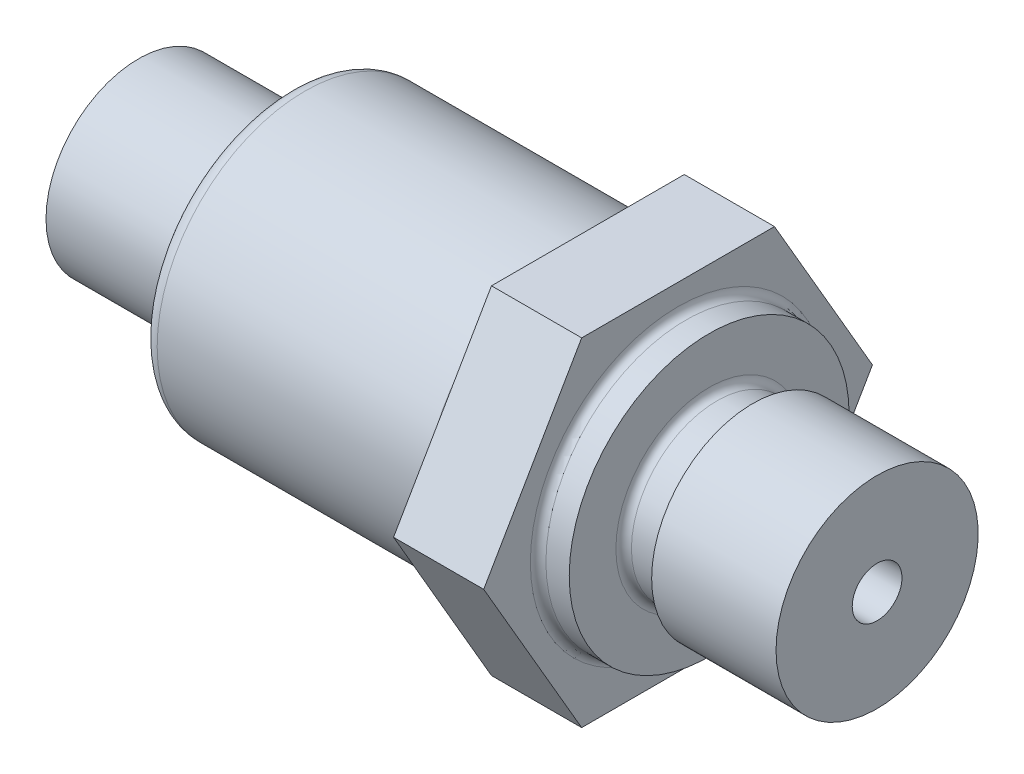
ISO-10303-21;
HEADER;
FILE_DESCRIPTION(('STEP AP214'),'2;1');
FILE_NAME('part.step','',(''),(''),'','','');
FILE_SCHEMA(('AUTOMOTIVE_DESIGN { 1 0 10303 214 1 1 1 1 }'));
ENDSEC;
DATA;
#1=APPLICATION_CONTEXT('core data for automotive mechanical design processes');
#2=APPLICATION_PROTOCOL_DEFINITION('international standard','automotive_design',2000,#1);
#3=PRODUCT_CONTEXT('',#1,'mechanical');
#4=PRODUCT('Part','Part','',(#3));
#5=PRODUCT_RELATED_PRODUCT_CATEGORY('part','',(#4));
#6=PRODUCT_DEFINITION_FORMATION('','',#4);
#7=PRODUCT_DEFINITION_CONTEXT('part definition',#1,'design');
#8=PRODUCT_DEFINITION('design','',#6,#7);
#9=PRODUCT_DEFINITION_SHAPE('','',#8);
#10=(LENGTH_UNIT() NAMED_UNIT(*) SI_UNIT(.MILLI.,.METRE.));
#11=(NAMED_UNIT(*) PLANE_ANGLE_UNIT() SI_UNIT($,.RADIAN.));
#12=(NAMED_UNIT(*) SI_UNIT($,.STERADIAN.) SOLID_ANGLE_UNIT());
#13=UNCERTAINTY_MEASURE_WITH_UNIT(LENGTH_MEASURE(1.E-05),#10,'distance_accuracy_value','');
#14=(GEOMETRIC_REPRESENTATION_CONTEXT(3) GLOBAL_UNCERTAINTY_ASSIGNED_CONTEXT((#13)) GLOBAL_UNIT_ASSIGNED_CONTEXT((#10,
#11,#12)) REPRESENTATION_CONTEXT('',''));
#15=CARTESIAN_POINT('',(0.,0.,0.));
#16=DIRECTION('',(0.,0.,1.));
#17=DIRECTION('',(1.,0.,0.));
#18=AXIS2_PLACEMENT_3D('',#15,#16,#17);
#19=CARTESIAN_POINT('',(34.7,12.5,0.));
#20=DIRECTION('',(-1.,0.,0.));
#21=DIRECTION('',(0.,0.,1.));
#22=AXIS2_PLACEMENT_3D('',#19,#20,#21);
#23=PLANE('',#22);
#24=DIRECTION('',(0.,0.,-1.));
#25=VECTOR('',#24,1.);
#26=CARTESIAN_POINT('',(34.7,10.8540315090753,6.2));
#27=LINE('',#26,#25);
#28=CARTESIAN_POINT('',(34.7,10.8540315090753,6.2));
#29=VERTEX_POINT('',#28);
#30=CARTESIAN_POINT('',(34.7,10.8540315090753,-6.2));
#31=VERTEX_POINT('',#30);
#32=EDGE_CURVE('E92',#29,#31,#27,.T.);
#33=ORIENTED_EDGE('',*,*,#32,.F.);
#34=DIRECTION('',(0.,0.864869932417586,-0.501996015920445));
#35=VECTOR('',#34,1.);
#36=CARTESIAN_POINT('',(34.7,0.,12.5));
#37=LINE('',#36,#35);
#38=CARTESIAN_POINT('',(34.7,0.,12.5));
#39=VERTEX_POINT('',#38);
#40=EDGE_CURVE('E100',#39,#29,#37,.T.);
#41=ORIENTED_EDGE('',*,*,#40,.F.);
#42=DIRECTION('',(0.,0.864869932417586,0.501996015920445));
#43=VECTOR('',#42,1.);
#44=CARTESIAN_POINT('',(34.7,-10.8540315090753,6.2));
#45=LINE('',#44,#43);
#46=CARTESIAN_POINT('',(34.7,-10.8540315090753,6.2));
#47=VERTEX_POINT('',#46);
#48=EDGE_CURVE('E119',#47,#39,#45,.T.);
#49=ORIENTED_EDGE('',*,*,#48,.F.);
#50=DIRECTION('',(0.,0.,1.));
#51=VECTOR('',#50,1.);
#52=CARTESIAN_POINT('',(34.7,-10.8540315090753,-6.2));
#53=LINE('',#52,#51);
#54=CARTESIAN_POINT('',(34.7,-10.8540315090753,-6.2));
#55=VERTEX_POINT('',#54);
#56=EDGE_CURVE('E111',#55,#47,#53,.T.);
#57=ORIENTED_EDGE('',*,*,#56,.F.);
#58=DIRECTION('',(0.,-0.864869932417586,0.501996015920445));
#59=VECTOR('',#58,1.);
#60=CARTESIAN_POINT('',(34.7,0.,-12.5));
#61=LINE('',#60,#59);
#62=CARTESIAN_POINT('',(34.7,0.,-12.5));
#63=VERTEX_POINT('',#62);
#64=EDGE_CURVE('E109',#63,#55,#61,.T.);
#65=ORIENTED_EDGE('',*,*,#64,.F.);
#66=DIRECTION('',(0.,-0.864869932417586,-0.501996015920445));
#67=VECTOR('',#66,1.);
#68=CARTESIAN_POINT('',(34.7,10.8540315090753,-6.2));
#69=LINE('',#68,#67);
#70=EDGE_CURVE('E99',#31,#63,#69,.T.);
#71=ORIENTED_EDGE('',*,*,#70,.F.);
#72=EDGE_LOOP('',(#33,#41,#49,#57,#65,#71));
#73=FACE_BOUND('',#72,.T.);
#74=CARTESIAN_POINT('',(34.7,0.,0.));
#75=DIRECTION('',(-1.,0.,0.));
#76=DIRECTION('',(0.,0.,1.));
#77=AXIS2_PLACEMENT_3D('',#74,#75,#76);
#78=CIRCLE('',#77,9.5);
#79=CARTESIAN_POINT('',(34.7,0.,9.5));
#80=VERTEX_POINT('',#79);
#81=EDGE_CURVE('E155',#80,#80,#78,.T.);
#82=ORIENTED_EDGE('',*,*,#81,.T.);
#83=EDGE_LOOP('',(#82));
#84=FACE_BOUND('',#83,.T.);
#85=ADVANCED_FACE('F40',(#73,#84),#23,.F.);
#86=CARTESIAN_POINT('',(35.2,0.,0.));
#87=DIRECTION('',(-1.,0.,0.));
#88=DIRECTION('',(0.,0.,1.));
#89=AXIS2_PLACEMENT_3D('',#86,#87,#88);
#90=TOROIDAL_SURFACE('',#89,9.5,0.5);
#91=ORIENTED_EDGE('',*,*,#81,.F.);
#92=EDGE_LOOP('',(#91));
#93=FACE_BOUND('',#92,.T.);
#94=CARTESIAN_POINT('',(35.2,0.,0.));
#95=DIRECTION('',(-1.,0.,0.));
#96=DIRECTION('',(0.,0.,1.));
#97=AXIS2_PLACEMENT_3D('',#94,#95,#96);
#98=CIRCLE('',#97,9.);
#99=CARTESIAN_POINT('',(35.2,0.,9.));
#100=VERTEX_POINT('',#99);
#101=EDGE_CURVE('E152',#100,#100,#98,.T.);
#102=ORIENTED_EDGE('',*,*,#101,.T.);
#103=EDGE_LOOP('',(#102));
#104=FACE_BOUND('',#103,.T.);
#105=ADVANCED_FACE('F243',(#93,#104),#90,.F.);
#106=CARTESIAN_POINT('',(0.,0.,0.));
#107=DIRECTION('',(-1.,0.,0.));
#108=DIRECTION('',(0.,0.,1.));
#109=AXIS2_PLACEMENT_3D('',#106,#107,#108);
#110=CYLINDRICAL_SURFACE('',#109,9.);
#111=ORIENTED_EDGE('',*,*,#101,.F.);
#112=EDGE_LOOP('',(#111));
#113=FACE_BOUND('',#112,.T.);
#114=CARTESIAN_POINT('',(36.7,0.,0.));
#115=DIRECTION('',(-1.,0.,0.));
#116=DIRECTION('',(0.,0.,1.));
#117=AXIS2_PLACEMENT_3D('',#114,#115,#116);
#118=CIRCLE('',#117,9.);
#119=CARTESIAN_POINT('',(36.7,0.,9.));
#120=VERTEX_POINT('',#119);
#121=EDGE_CURVE('E149',#120,#120,#118,.T.);
#122=ORIENTED_EDGE('',*,*,#121,.T.);
#123=EDGE_LOOP('',(#122));
#124=FACE_BOUND('',#123,.T.);
#125=ADVANCED_FACE('F250',(#113,#124),#110,.T.);
#126=CARTESIAN_POINT('',(36.7,6.5,0.));
#127=DIRECTION('',(-1.,0.,0.));
#128=DIRECTION('',(0.,0.,1.));
#129=AXIS2_PLACEMENT_3D('',#126,#127,#128);
#130=PLANE('',#129);
#131=ORIENTED_EDGE('',*,*,#121,.F.);
#132=EDGE_LOOP('',(#131));
#133=FACE_BOUND('',#132,.T.);
#134=CARTESIAN_POINT('',(36.7,0.,0.));
#135=DIRECTION('',(-1.,0.,0.));
#136=DIRECTION('',(0.,0.,1.));
#137=AXIS2_PLACEMENT_3D('',#134,#135,#136);
#138=CIRCLE('',#137,6.);
#139=CARTESIAN_POINT('',(36.7,0.,6.));
#140=VERTEX_POINT('',#139);
#141=EDGE_CURVE('E146',#140,#140,#138,.T.);
#142=ORIENTED_EDGE('',*,*,#141,.T.);
#143=EDGE_LOOP('',(#142));
#144=FACE_BOUND('',#143,.T.);
#145=ADVANCED_FACE('F314',(#133,#144),#130,.F.);
#146=CARTESIAN_POINT('',(37.2,0.,0.));
#147=DIRECTION('',(-1.,0.,0.));
#148=DIRECTION('',(0.,0.,1.));
#149=AXIS2_PLACEMENT_3D('',#146,#147,#148);
#150=TOROIDAL_SURFACE('',#149,6.,0.5);
#151=ORIENTED_EDGE('',*,*,#141,.F.);
#152=EDGE_LOOP('',(#151));
#153=FACE_BOUND('',#152,.T.);
#154=CARTESIAN_POINT('',(37.2,0.,0.));
#155=DIRECTION('',(-1.,0.,0.));
#156=DIRECTION('',(0.,0.,1.));
#157=AXIS2_PLACEMENT_3D('',#154,#155,#156);
#158=CIRCLE('',#157,5.5);
#159=CARTESIAN_POINT('',(37.2,0.,5.5));
#160=VERTEX_POINT('',#159);
#161=EDGE_CURVE('E143',#160,#160,#158,.T.);
#162=ORIENTED_EDGE('',*,*,#161,.T.);
#163=EDGE_LOOP('',(#162));
#164=FACE_BOUND('',#163,.T.);
#165=ADVANCED_FACE('F310',(#153,#164),#150,.F.);
#166=CARTESIAN_POINT('',(0.,0.,0.));
#167=DIRECTION('',(-1.,0.,0.));
#168=DIRECTION('',(0.,0.,1.));
#169=AXIS2_PLACEMENT_3D('',#166,#167,#168);
#170=CYLINDRICAL_SURFACE('',#169,5.5);
#171=ORIENTED_EDGE('',*,*,#161,.F.);
#172=EDGE_LOOP('',(#171));
#173=FACE_BOUND('',#172,.T.);
#174=CARTESIAN_POINT('',(39.,0.,0.));
#175=DIRECTION('',(-1.,0.,0.));
#176=DIRECTION('',(0.,0.,1.));
#177=AXIS2_PLACEMENT_3D('',#174,#175,#176);
#178=CIRCLE('',#177,5.5);
#179=CARTESIAN_POINT('',(39.,0.,5.5));
#180=VERTEX_POINT('',#179);
#181=EDGE_CURVE('E140',#180,#180,#178,.T.);
#182=ORIENTED_EDGE('',*,*,#181,.T.);
#183=EDGE_LOOP('',(#182));
#184=FACE_BOUND('',#183,.T.);
#185=ADVANCED_FACE('F306',(#173,#184),#170,.T.);
#186=CARTESIAN_POINT('',(39.,0.,0.));
#187=DIRECTION('',(-1.,0.,0.));
#188=DIRECTION('',(0.,0.,1.));
#189=AXIS2_PLACEMENT_3D('',#186,#187,#188);
#190=TOROIDAL_SURFACE('',#189,6.,0.5);
#191=ORIENTED_EDGE('',*,*,#181,.F.);
#192=EDGE_LOOP('',(#191));
#193=FACE_BOUND('',#192,.T.);
#194=CARTESIAN_POINT('',(39.5,0.,0.));
#195=DIRECTION('',(-1.,0.,0.));
#196=DIRECTION('',(0.,0.,1.));
#197=AXIS2_PLACEMENT_3D('',#194,#195,#196);
#198=CIRCLE('',#197,6.);
#199=CARTESIAN_POINT('',(39.5,0.,6.));
#200=VERTEX_POINT('',#199);
#201=EDGE_CURVE('E137',#200,#200,#198,.T.);
#202=ORIENTED_EDGE('',*,*,#201,.T.);
#203=EDGE_LOOP('',(#202));
#204=FACE_BOUND('',#203,.T.);
#205=ADVANCED_FACE('F302',(#193,#204),#190,.F.);
#206=CARTESIAN_POINT('',(39.5,6.,0.));
#207=DIRECTION('',(1.,0.,0.));
#208=DIRECTION('',(0.,0.,-1.));
#209=AXIS2_PLACEMENT_3D('',#206,#207,#208);
#210=PLANE('',#209);
#211=ORIENTED_EDGE('',*,*,#201,.F.);
#212=EDGE_LOOP('',(#211));
#213=FACE_BOUND('',#212,.T.);
#214=CARTESIAN_POINT('',(39.5,0.,0.));
#215=DIRECTION('',(-1.,0.,0.));
#216=DIRECTION('',(0.,0.,1.));
#217=AXIS2_PLACEMENT_3D('',#214,#215,#216);
#218=CIRCLE('',#217,6.5);
#219=CARTESIAN_POINT('',(39.5,0.,6.5));
#220=VERTEX_POINT('',#219);
#221=EDGE_CURVE('E134',#220,#220,#218,.T.);
#222=ORIENTED_EDGE('',*,*,#221,.T.);
#223=EDGE_LOOP('',(#222));
#224=FACE_BOUND('',#223,.T.);
#225=ADVANCED_FACE('F298',(#213,#224),#210,.F.);
#226=CARTESIAN_POINT('',(0.,0.,0.));
#227=DIRECTION('',(-1.,0.,0.));
#228=DIRECTION('',(0.,0.,1.));
#229=AXIS2_PLACEMENT_3D('',#226,#227,#228);
#230=CYLINDRICAL_SURFACE('',#229,6.5);
#231=ORIENTED_EDGE('',*,*,#221,.F.);
#232=EDGE_LOOP('',(#231));
#233=FACE_BOUND('',#232,.T.);
#234=CARTESIAN_POINT('',(47.5,0.,0.));
#235=DIRECTION('',(-1.,0.,0.));
#236=DIRECTION('',(0.,0.,1.));
#237=AXIS2_PLACEMENT_3D('',#234,#235,#236);
#238=CIRCLE('',#237,6.5);
#239=CARTESIAN_POINT('',(47.5,0.,6.5));
#240=VERTEX_POINT('',#239);
#241=EDGE_CURVE('E131',#240,#240,#238,.T.);
#242=ORIENTED_EDGE('',*,*,#241,.T.);
#243=EDGE_LOOP('',(#242));
#244=FACE_BOUND('',#243,.T.);
#245=ADVANCED_FACE('F294',(#233,#244),#230,.T.);
#246=CARTESIAN_POINT('',(47.5,6.5,0.));
#247=DIRECTION('',(-1.,0.,0.));
#248=DIRECTION('',(0.,0.,1.));
#249=AXIS2_PLACEMENT_3D('',#246,#247,#248);
#250=PLANE('',#249);
#251=ORIENTED_EDGE('',*,*,#241,.F.);
#252=EDGE_LOOP('',(#251));
#253=FACE_BOUND('',#252,.T.);
#254=CARTESIAN_POINT('',(47.5,0.,0.));
#255=DIRECTION('',(-1.,0.,0.));
#256=DIRECTION('',(0.,0.,1.));
#257=AXIS2_PLACEMENT_3D('',#254,#255,#256);
#258=CIRCLE('',#257,1.6);
#259=CARTESIAN_POINT('',(47.5,0.,1.6));
#260=VERTEX_POINT('',#259);
#261=EDGE_CURVE('E128',#260,#260,#258,.T.);
#262=ORIENTED_EDGE('',*,*,#261,.T.);
#263=EDGE_LOOP('',(#262));
#264=FACE_BOUND('',#263,.T.);
#265=ADVANCED_FACE('F290',(#253,#264),#250,.F.);
#266=CARTESIAN_POINT('',(0.,0.,0.));
#267=DIRECTION('',(-1.,0.,0.));
#268=DIRECTION('',(0.,0.,1.));
#269=AXIS2_PLACEMENT_3D('',#266,#267,#268);
#270=CYLINDRICAL_SURFACE('',#269,1.6);
#271=ORIENTED_EDGE('',*,*,#261,.F.);
#272=EDGE_LOOP('',(#271));
#273=FACE_BOUND('',#272,.T.);
#274=CARTESIAN_POINT('',(32.5,0.,0.));
#275=DIRECTION('',(-1.,0.,0.));
#276=DIRECTION('',(0.,0.,1.));
#277=AXIS2_PLACEMENT_3D('',#274,#275,#276);
#278=CIRCLE('',#277,1.6);
#279=CARTESIAN_POINT('',(32.5,0.,1.6));
#280=VERTEX_POINT('',#279);
#281=EDGE_CURVE('E125',#280,#280,#278,.T.);
#282=ORIENTED_EDGE('',*,*,#281,.T.);
#283=EDGE_LOOP('',(#282));
#284=FACE_BOUND('',#283,.T.);
#285=ADVANCED_FACE('F286',(#273,#284),#270,.F.);
#286=CARTESIAN_POINT('',(32.5,1.6,0.));
#287=DIRECTION('',(-1.,0.,0.));
#288=DIRECTION('',(0.,0.,1.));
#289=AXIS2_PLACEMENT_3D('',#286,#287,#288);
#290=PLANE('',#289);
#291=ORIENTED_EDGE('',*,*,#281,.F.);
#292=EDGE_LOOP('',(#291));
#293=FACE_BOUND('',#292,.T.);
#294=ADVANCED_FACE('F283',(#293),#290,.F.);
#295=CARTESIAN_POINT('',(70.4088924499207,0.,12.5));
#296=DIRECTION('',(0.,-0.501996015920445,-0.864869932417586));
#297=DIRECTION('',(0.,0.864869932417586,-0.501996015920445));
#298=AXIS2_PLACEMENT_3D('',#295,#296,#297);
#299=PLANE('',#298);
#300=ORIENTED_EDGE('',*,*,#40,.T.);
#301=DIRECTION('',(-1.,0.,0.));
#302=VECTOR('',#301,1.);
#303=CARTESIAN_POINT('',(70.4088924499207,10.8540315090753,6.2));
#304=LINE('',#303,#302);
#305=CARTESIAN_POINT('',(28.9,10.8540315090753,6.2));
#306=VERTEX_POINT('',#305);
#307=EDGE_CURVE('E63',#29,#306,#304,.T.);
#308=ORIENTED_EDGE('',*,*,#307,.T.);
#309=DIRECTION('',(0.,-0.864869932417586,0.501996015920445));
#310=VECTOR('',#309,1.);
#311=CARTESIAN_POINT('',(28.9,0.,12.5));
#312=LINE('',#311,#310);
#313=CARTESIAN_POINT('',(28.9,0.,12.5));
#314=VERTEX_POINT('',#313);
#315=EDGE_CURVE('E199',#306,#314,#312,.T.);
#316=ORIENTED_EDGE('',*,*,#315,.T.);
#317=DIRECTION('',(-1.,0.,0.));
#318=VECTOR('',#317,1.);
#319=CARTESIAN_POINT('',(70.4088924499207,0.,12.5));
#320=LINE('',#319,#318);
#321=EDGE_CURVE('E211',#39,#314,#320,.T.);
#322=ORIENTED_EDGE('',*,*,#321,.F.);
#323=EDGE_LOOP('',(#300,#308,#316,#322));
#324=FACE_BOUND('',#323,.T.);
#325=ADVANCED_FACE('F228',(#324),#299,.F.);
#326=CARTESIAN_POINT('',(70.4088924499207,-10.8540315090753,6.2));
#327=DIRECTION('',(0.,0.501996015920445,-0.864869932417586));
#328=DIRECTION('',(0.,0.864869932417586,0.501996015920445));
#329=AXIS2_PLACEMENT_3D('',#326,#327,#328);
#330=PLANE('',#329);
#331=ORIENTED_EDGE('',*,*,#48,.T.);
#332=ORIENTED_EDGE('',*,*,#321,.T.);
#333=DIRECTION('',(0.,-0.864869932417586,-0.501996015920445));
#334=VECTOR('',#333,1.);
#335=CARTESIAN_POINT('',(28.9,-10.8540315090753,6.2));
#336=LINE('',#335,#334);
#337=CARTESIAN_POINT('',(28.9,-10.8540315090753,6.2));
#338=VERTEX_POINT('',#337);
#339=EDGE_CURVE('E197',#314,#338,#336,.T.);
#340=ORIENTED_EDGE('',*,*,#339,.T.);
#341=DIRECTION('',(-1.,0.,0.));
#342=VECTOR('',#341,1.);
#343=CARTESIAN_POINT('',(70.4088924499207,-10.8540315090753,6.2));
#344=LINE('',#343,#342);
#345=EDGE_CURVE('E213',#47,#338,#344,.T.);
#346=ORIENTED_EDGE('',*,*,#345,.F.);
#347=EDGE_LOOP('',(#331,#332,#340,#346));
#348=FACE_BOUND('',#347,.T.);
#349=ADVANCED_FACE('F225',(#348),#330,.F.);
#350=CARTESIAN_POINT('',(70.4088924499207,-10.8540315090753,-6.2));
#351=DIRECTION('',(0.,1.,0.));
#352=DIRECTION('',(0.,0.,1.));
#353=AXIS2_PLACEMENT_3D('',#350,#351,#352);
#354=PLANE('',#353);
#355=ORIENTED_EDGE('',*,*,#56,.T.);
#356=ORIENTED_EDGE('',*,*,#345,.T.);
#357=DIRECTION('',(0.,0.,-1.));
#358=VECTOR('',#357,1.);
#359=CARTESIAN_POINT('',(28.9,-10.8540315090753,-6.2));
#360=LINE('',#359,#358);
#361=CARTESIAN_POINT('',(28.9,-10.8540315090753,-6.2));
#362=VERTEX_POINT('',#361);
#363=EDGE_CURVE('E202',#338,#362,#360,.T.);
#364=ORIENTED_EDGE('',*,*,#363,.T.);
#365=DIRECTION('',(-1.,0.,0.));
#366=VECTOR('',#365,1.);
#367=CARTESIAN_POINT('',(70.4088924499207,-10.8540315090753,-6.2));
#368=LINE('',#367,#366);
#369=EDGE_CURVE('E216',#55,#362,#368,.T.);
#370=ORIENTED_EDGE('',*,*,#369,.F.);
#371=EDGE_LOOP('',(#355,#356,#364,#370));
#372=FACE_BOUND('',#371,.T.);
#373=ADVANCED_FACE('F223',(#372),#354,.F.);
#374=CARTESIAN_POINT('',(70.4088924499207,0.,-12.5));
#375=DIRECTION('',(0.,0.501996015920445,0.864869932417586));
#376=DIRECTION('',(0.,-0.864869932417586,0.501996015920445));
#377=AXIS2_PLACEMENT_3D('',#374,#375,#376);
#378=PLANE('',#377);
#379=ORIENTED_EDGE('',*,*,#64,.T.);
#380=ORIENTED_EDGE('',*,*,#369,.T.);
#381=DIRECTION('',(0.,0.864869932417586,-0.501996015920445));
#382=VECTOR('',#381,1.);
#383=CARTESIAN_POINT('',(28.9,0.,-12.5));
#384=LINE('',#383,#382);
#385=CARTESIAN_POINT('',(28.9,0.,-12.5));
#386=VERTEX_POINT('',#385);
#387=EDGE_CURVE('E206',#362,#386,#384,.T.);
#388=ORIENTED_EDGE('',*,*,#387,.T.);
#389=DIRECTION('',(-1.,0.,0.));
#390=VECTOR('',#389,1.);
#391=CARTESIAN_POINT('',(70.4088924499207,0.,-12.5));
#392=LINE('',#391,#390);
#393=EDGE_CURVE('E104',#63,#386,#392,.T.);
#394=ORIENTED_EDGE('',*,*,#393,.F.);
#395=EDGE_LOOP('',(#379,#380,#388,#394));
#396=FACE_BOUND('',#395,.T.);
#397=ADVANCED_FACE('F233',(#396),#378,.F.);
#398=CARTESIAN_POINT('',(70.4088924499207,10.8540315090753,-6.2));
#399=DIRECTION('',(0.,-0.501996015920445,0.864869932417586));
#400=DIRECTION('',(0.,-0.864869932417586,-0.501996015920445));
#401=AXIS2_PLACEMENT_3D('',#398,#399,#400);
#402=PLANE('',#401);
#403=ORIENTED_EDGE('',*,*,#70,.T.);
#404=ORIENTED_EDGE('',*,*,#393,.T.);
#405=DIRECTION('',(0.,0.864869932417586,0.501996015920445));
#406=VECTOR('',#405,1.);
#407=CARTESIAN_POINT('',(28.9,10.8540315090753,-6.2));
#408=LINE('',#407,#406);
#409=CARTESIAN_POINT('',(28.9,10.8540315090753,-6.2));
#410=VERTEX_POINT('',#409);
#411=EDGE_CURVE('E55',#386,#410,#408,.T.);
#412=ORIENTED_EDGE('',*,*,#411,.T.);
#413=DIRECTION('',(-1.,0.,0.));
#414=VECTOR('',#413,1.);
#415=CARTESIAN_POINT('',(70.4088924499207,10.8540315090753,-6.2));
#416=LINE('',#415,#414);
#417=EDGE_CURVE('E94',#31,#410,#416,.T.);
#418=ORIENTED_EDGE('',*,*,#417,.F.);
#419=EDGE_LOOP('',(#403,#404,#412,#418));
#420=FACE_BOUND('',#419,.T.);
#421=ADVANCED_FACE('F102',(#420),#402,.F.);
#422=CARTESIAN_POINT('',(70.4088924499207,10.8540315090753,6.2));
#423=DIRECTION('',(0.,-1.,0.));
#424=DIRECTION('',(0.,0.,-1.));
#425=AXIS2_PLACEMENT_3D('',#422,#423,#424);
#426=PLANE('',#425);
#427=ORIENTED_EDGE('',*,*,#32,.T.);
#428=ORIENTED_EDGE('',*,*,#417,.T.);
#429=DIRECTION('',(0.,0.,1.));
#430=VECTOR('',#429,1.);
#431=CARTESIAN_POINT('',(28.9,10.8540315090753,6.2));
#432=LINE('',#431,#430);
#433=EDGE_CURVE('E214',#410,#306,#432,.T.);
#434=ORIENTED_EDGE('',*,*,#433,.T.);
#435=ORIENTED_EDGE('',*,*,#307,.F.);
#436=EDGE_LOOP('',(#427,#428,#434,#435));
#437=FACE_BOUND('',#436,.T.);
#438=ADVANCED_FACE('F93',(#437),#426,.F.);
#439=CARTESIAN_POINT('',(9.4,4.1,0.));
#440=DIRECTION('',(1.,0.,0.));
#441=DIRECTION('',(0.,0.,-1.));
#442=AXIS2_PLACEMENT_3D('',#439,#440,#441);
#443=PLANE('',#442);
#444=CARTESIAN_POINT('',(9.4,0.,0.));
#445=DIRECTION('',(-1.,0.,0.));
#446=DIRECTION('',(0.,0.,1.));
#447=AXIS2_PLACEMENT_3D('',#444,#445,#446);
#448=CIRCLE('',#447,4.1);
#449=CARTESIAN_POINT('',(9.4,0.,4.1));
#450=VERTEX_POINT('',#449);
#451=EDGE_CURVE('E122',#450,#450,#448,.T.);
#452=ORIENTED_EDGE('',*,*,#451,.T.);
#453=EDGE_LOOP('',(#452));
#454=FACE_BOUND('',#453,.T.);
#455=ADVANCED_FACE('F273',(#454),#443,.F.);
#456=CARTESIAN_POINT('',(0.,0.,0.));
#457=DIRECTION('',(-1.,0.,0.));
#458=DIRECTION('',(0.,0.,1.));
#459=AXIS2_PLACEMENT_3D('',#456,#457,#458);
#460=CYLINDRICAL_SURFACE('',#459,4.1);
#461=ORIENTED_EDGE('',*,*,#451,.F.);
#462=EDGE_LOOP('',(#461));
#463=FACE_BOUND('',#462,.T.);
#464=CARTESIAN_POINT('',(0.,0.,0.));
#465=DIRECTION('',(-1.,0.,0.));
#466=DIRECTION('',(0.,0.,1.));
#467=AXIS2_PLACEMENT_3D('',#464,#465,#466);
#468=CIRCLE('',#467,4.1);
#469=CARTESIAN_POINT('',(0.,0.,4.1));
#470=VERTEX_POINT('',#469);
#471=EDGE_CURVE('E118',#470,#470,#468,.T.);
#472=ORIENTED_EDGE('',*,*,#471,.T.);
#473=EDGE_LOOP('',(#472));
#474=FACE_BOUND('',#473,.T.);
#475=ADVANCED_FACE('F265',(#463,#474),#460,.F.);
#476=CARTESIAN_POINT('',(0.,4.1,0.));
#477=DIRECTION('',(1.,0.,0.));
#478=DIRECTION('',(0.,0.,-1.));
#479=AXIS2_PLACEMENT_3D('',#476,#477,#478);
#480=PLANE('',#479);
#481=ORIENTED_EDGE('',*,*,#471,.F.);
#482=EDGE_LOOP('',(#481));
#483=FACE_BOUND('',#482,.T.);
#484=CARTESIAN_POINT('',(0.,0.,0.));
#485=DIRECTION('',(-1.,0.,0.));
#486=DIRECTION('',(0.,0.,1.));
#487=AXIS2_PLACEMENT_3D('',#484,#485,#486);
#488=CIRCLE('',#487,5.95);
#489=CARTESIAN_POINT('',(0.,0.,5.95));
#490=VERTEX_POINT('',#489);
#491=EDGE_CURVE('E115',#490,#490,#488,.T.);
#492=ORIENTED_EDGE('',*,*,#491,.T.);
#493=EDGE_LOOP('',(#492));
#494=FACE_BOUND('',#493,.T.);
#495=ADVANCED_FACE('F259',(#483,#494),#480,.F.);
#496=CARTESIAN_POINT('',(0.,0.,0.));
#497=DIRECTION('',(-1.,0.,0.));
#498=DIRECTION('',(0.,0.,1.));
#499=AXIS2_PLACEMENT_3D('',#496,#497,#498);
#500=CYLINDRICAL_SURFACE('',#499,5.95);
#501=ORIENTED_EDGE('',*,*,#491,.F.);
#502=EDGE_LOOP('',(#501));
#503=FACE_BOUND('',#502,.T.);
#504=CARTESIAN_POINT('',(9.7,0.,0.));
#505=DIRECTION('',(-1.,0.,0.));
#506=DIRECTION('',(0.,0.,1.));
#507=AXIS2_PLACEMENT_3D('',#504,#505,#506);
#508=CIRCLE('',#507,5.95);
#509=CARTESIAN_POINT('',(9.7,0.,5.95));
#510=VERTEX_POINT('',#509);
#511=EDGE_CURVE('E12',#510,#510,#508,.T.);
#512=ORIENTED_EDGE('',*,*,#511,.T.);
#513=EDGE_LOOP('',(#512));
#514=FACE_BOUND('',#513,.T.);
#515=ADVANCED_FACE('F42',(#503,#514),#500,.T.);
#516=CARTESIAN_POINT('',(9.7,5.95,0.));
#517=DIRECTION('',(1.,0.,0.));
#518=DIRECTION('',(0.,0.,-1.));
#519=AXIS2_PLACEMENT_3D('',#516,#517,#518);
#520=PLANE('',#519);
#521=ORIENTED_EDGE('',*,*,#511,.F.);
#522=EDGE_LOOP('',(#521));
#523=FACE_BOUND('',#522,.T.);
#524=CARTESIAN_POINT('',(9.7,0.,0.));
#525=DIRECTION('',(-1.,0.,0.));
#526=DIRECTION('',(0.,0.,1.));
#527=AXIS2_PLACEMENT_3D('',#524,#525,#526);
#528=CIRCLE('',#527,8.49999999999999);
#529=CARTESIAN_POINT('',(9.7,0.,8.49999999999999));
#530=VERTEX_POINT('',#529);
#531=EDGE_CURVE('E48',#530,#530,#528,.T.);
#532=ORIENTED_EDGE('',*,*,#531,.T.);
#533=EDGE_LOOP('',(#532));
#534=FACE_BOUND('',#533,.T.);
#535=ADVANCED_FACE('F169',(#523,#534),#520,.F.);
#536=CARTESIAN_POINT('',(10.7,0.,0.));
#537=DIRECTION('',(-1.,0.,0.));
#538=DIRECTION('',(0.,0.,1.));
#539=AXIS2_PLACEMENT_3D('',#536,#537,#538);
#540=TOROIDAL_SURFACE('',#539,8.5,1.);
#541=ORIENTED_EDGE('',*,*,#531,.F.);
#542=EDGE_LOOP('',(#541));
#543=FACE_BOUND('',#542,.T.);
#544=CARTESIAN_POINT('',(10.7,0.,0.));
#545=DIRECTION('',(-1.,0.,0.));
#546=DIRECTION('',(0.,0.,1.));
#547=AXIS2_PLACEMENT_3D('',#544,#545,#546);
#548=CIRCLE('',#547,9.5);
#549=CARTESIAN_POINT('',(10.7,0.,9.5));
#550=VERTEX_POINT('',#549);
#551=EDGE_CURVE('E164',#550,#550,#548,.T.);
#552=ORIENTED_EDGE('',*,*,#551,.T.);
#553=EDGE_LOOP('',(#552));
#554=FACE_BOUND('',#553,.T.);
#555=ADVANCED_FACE('F171',(#543,#554),#540,.T.);
#556=CARTESIAN_POINT('',(0.,0.,0.));
#557=DIRECTION('',(-1.,0.,0.));
#558=DIRECTION('',(0.,0.,1.));
#559=AXIS2_PLACEMENT_3D('',#556,#557,#558);
#560=CYLINDRICAL_SURFACE('',#559,9.5);
#561=ORIENTED_EDGE('',*,*,#551,.F.);
#562=EDGE_LOOP('',(#561));
#563=FACE_BOUND('',#562,.T.);
#564=CARTESIAN_POINT('',(27.9,0.,0.));
#565=DIRECTION('',(-1.,0.,0.));
#566=DIRECTION('',(0.,0.,1.));
#567=AXIS2_PLACEMENT_3D('',#564,#565,#566);
#568=CIRCLE('',#567,9.5);
#569=CARTESIAN_POINT('',(27.9,0.,9.5));
#570=VERTEX_POINT('',#569);
#571=EDGE_CURVE('E161',#570,#570,#568,.T.);
#572=ORIENTED_EDGE('',*,*,#571,.T.);
#573=EDGE_LOOP('',(#572));
#574=FACE_BOUND('',#573,.T.);
#575=ADVANCED_FACE('F174',(#563,#574),#560,.T.);
#576=CARTESIAN_POINT('',(27.9,0.,0.));
#577=DIRECTION('',(-1.,0.,0.));
#578=DIRECTION('',(0.,0.,1.));
#579=AXIS2_PLACEMENT_3D('',#576,#577,#578);
#580=TOROIDAL_SURFACE('',#579,10.5,1.);
#581=ORIENTED_EDGE('',*,*,#571,.F.);
#582=EDGE_LOOP('',(#581));
#583=FACE_BOUND('',#582,.T.);
#584=CARTESIAN_POINT('',(28.9,0.,0.));
#585=DIRECTION('',(-1.,0.,0.));
#586=DIRECTION('',(0.,0.,1.));
#587=AXIS2_PLACEMENT_3D('',#584,#585,#586);
#588=CIRCLE('',#587,10.5);
#589=CARTESIAN_POINT('',(28.9,0.,10.5));
#590=VERTEX_POINT('',#589);
#591=EDGE_CURVE('E158',#590,#590,#588,.T.);
#592=ORIENTED_EDGE('',*,*,#591,.T.);
#593=EDGE_LOOP('',(#592));
#594=FACE_BOUND('',#593,.T.);
#595=ADVANCED_FACE('F180',(#583,#594),#580,.F.);
#596=CARTESIAN_POINT('',(28.9,10.5,0.));
#597=DIRECTION('',(1.,0.,0.));
#598=DIRECTION('',(0.,0.,-1.));
#599=AXIS2_PLACEMENT_3D('',#596,#597,#598);
#600=PLANE('',#599);
#601=ORIENTED_EDGE('',*,*,#591,.F.);
#602=EDGE_LOOP('',(#601));
#603=FACE_BOUND('',#602,.T.);
#604=ORIENTED_EDGE('',*,*,#339,.F.);
#605=ORIENTED_EDGE('',*,*,#315,.F.);
#606=ORIENTED_EDGE('',*,*,#433,.F.);
#607=ORIENTED_EDGE('',*,*,#411,.F.);
#608=ORIENTED_EDGE('',*,*,#387,.F.);
#609=ORIENTED_EDGE('',*,*,#363,.F.);
#610=EDGE_LOOP('',(#604,#605,#606,#607,#608,#609));
#611=FACE_BOUND('',#610,.T.);
#612=ADVANCED_FACE('F186',(#603,#611),#600,.F.);
#613=CLOSED_SHELL('',(#85,#105,#125,#145,#165,#185,#205,#225,#245,#265,#285,#294,#325,#349,#373,
#397,#421,#438,#455,#475,#495,#515,#535,#555,#575,#595,#612));
#614=MANIFOLD_SOLID_BREP('B2',#613);
#615=ADVANCED_BREP_SHAPE_REPRESENTATION('',(#18,#614),#14);
#616=SHAPE_DEFINITION_REPRESENTATION(#9,#615);
ENDSEC;
END-ISO-10303-21;
